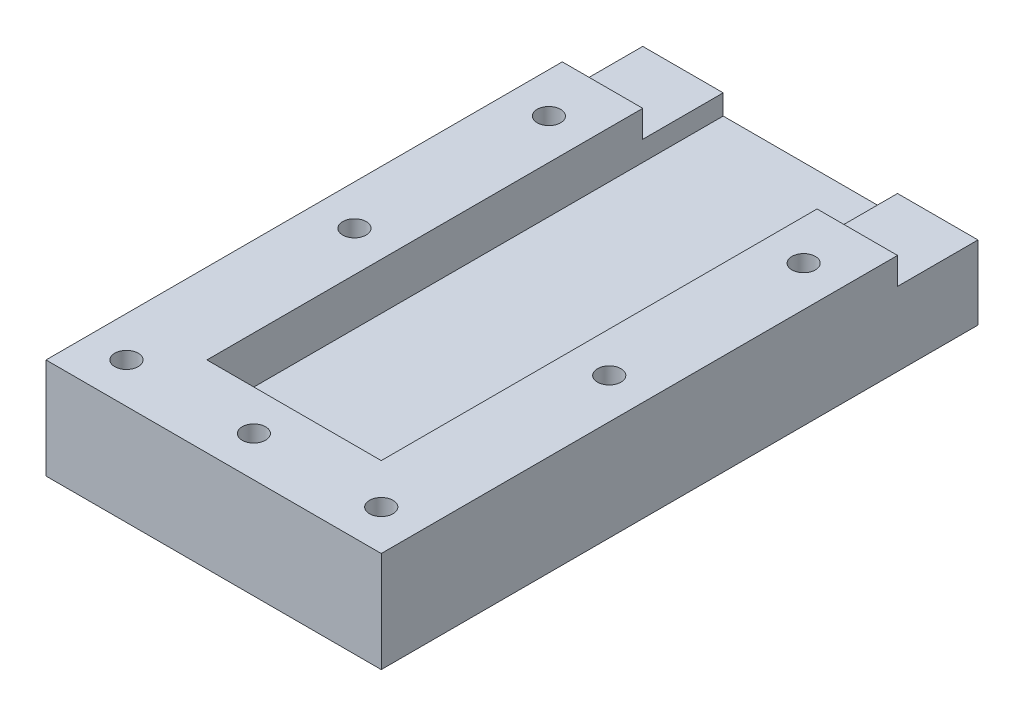
ISO-10303-21;
HEADER;
FILE_DESCRIPTION(('STEP AP214'),'2;1');
FILE_NAME('part.step','',(''),(''),'','','');
FILE_SCHEMA(('AUTOMOTIVE_DESIGN { 1 0 10303 214 1 1 1 1 }'));
ENDSEC;
DATA;
#1=APPLICATION_CONTEXT('core data for automotive mechanical design processes');
#2=APPLICATION_PROTOCOL_DEFINITION('international standard','automotive_design',2000,#1);
#3=PRODUCT_CONTEXT('',#1,'mechanical');
#4=PRODUCT('Part','Part','',(#3));
#5=PRODUCT_RELATED_PRODUCT_CATEGORY('part','',(#4));
#6=PRODUCT_DEFINITION_FORMATION('','',#4);
#7=PRODUCT_DEFINITION_CONTEXT('part definition',#1,'design');
#8=PRODUCT_DEFINITION('design','',#6,#7);
#9=PRODUCT_DEFINITION_SHAPE('','',#8);
#10=(LENGTH_UNIT() NAMED_UNIT(*) SI_UNIT(.MILLI.,.METRE.));
#11=(NAMED_UNIT(*) PLANE_ANGLE_UNIT() SI_UNIT($,.RADIAN.));
#12=(NAMED_UNIT(*) SI_UNIT($,.STERADIAN.) SOLID_ANGLE_UNIT());
#13=UNCERTAINTY_MEASURE_WITH_UNIT(LENGTH_MEASURE(1.E-05),#10,'distance_accuracy_value','');
#14=(GEOMETRIC_REPRESENTATION_CONTEXT(3) GLOBAL_UNCERTAINTY_ASSIGNED_CONTEXT((#13)) GLOBAL_UNIT_ASSIGNED_CONTEXT((#10,
#11,#12)) REPRESENTATION_CONTEXT('',''));
#15=CARTESIAN_POINT('',(0.,0.,0.));
#16=DIRECTION('',(0.,0.,1.));
#17=DIRECTION('',(1.,0.,0.));
#18=AXIS2_PLACEMENT_3D('',#15,#16,#17);
#19=CARTESIAN_POINT('',(0.,0.,0.));
#20=DIRECTION('',(0.,0.,1.));
#21=DIRECTION('',(1.,0.,0.));
#22=AXIS2_PLACEMENT_3D('',#19,#20,#21);
#23=PLANE('',#22);
#24=DIRECTION('',(0.,-1.,0.));
#25=VECTOR('',#24,1.);
#26=CARTESIAN_POINT('',(-25.,15.,0.));
#27=LINE('',#26,#25);
#28=CARTESIAN_POINT('',(-25.,-4.,0.));
#29=VERTEX_POINT('',#28);
#30=CARTESIAN_POINT('',(-25.,-15.,0.));
#31=VERTEX_POINT('',#30);
#32=EDGE_CURVE('E208',#29,#31,#27,.T.);
#33=ORIENTED_EDGE('',*,*,#32,.F.);
#34=DIRECTION('',(1.,0.,0.));
#35=VECTOR('',#34,1.);
#36=CARTESIAN_POINT('',(-25.,-4.,0.));
#37=LINE('',#36,#35);
#38=CARTESIAN_POINT('',(-13.,-4.,0.));
#39=VERTEX_POINT('',#38);
#40=EDGE_CURVE('E159',#29,#39,#37,.T.);
#41=ORIENTED_EDGE('',*,*,#40,.T.);
#42=DIRECTION('',(0.,1.,0.));
#43=VECTOR('',#42,1.);
#44=CARTESIAN_POINT('',(-13.,7.,0.));
#45=LINE('',#44,#43);
#46=CARTESIAN_POINT('',(-13.,-7.,0.));
#47=VERTEX_POINT('',#46);
#48=EDGE_CURVE('E181',#47,#39,#45,.T.);
#49=ORIENTED_EDGE('',*,*,#48,.F.);
#50=DIRECTION('',(-1.,0.,0.));
#51=VECTOR('',#50,1.);
#52=CARTESIAN_POINT('',(-13.,-7.,0.));
#53=LINE('',#52,#51);
#54=CARTESIAN_POINT('',(13.,-7.,0.));
#55=VERTEX_POINT('',#54);
#56=EDGE_CURVE('E189',#55,#47,#53,.T.);
#57=ORIENTED_EDGE('',*,*,#56,.F.);
#58=DIRECTION('',(0.,-1.,0.));
#59=VECTOR('',#58,1.);
#60=CARTESIAN_POINT('',(13.,7.,0.));
#61=LINE('',#60,#59);
#62=CARTESIAN_POINT('',(13.,-4.,0.));
#63=VERTEX_POINT('',#62);
#64=EDGE_CURVE('E176',#63,#55,#61,.T.);
#65=ORIENTED_EDGE('',*,*,#64,.F.);
#66=DIRECTION('',(-1.,0.,0.));
#67=VECTOR('',#66,1.);
#68=CARTESIAN_POINT('',(25.,-4.,0.));
#69=LINE('',#68,#67);
#70=CARTESIAN_POINT('',(25.,-4.,0.));
#71=VERTEX_POINT('',#70);
#72=EDGE_CURVE('E60',#71,#63,#69,.T.);
#73=ORIENTED_EDGE('',*,*,#72,.F.);
#74=DIRECTION('',(0.,1.,0.));
#75=VECTOR('',#74,1.);
#76=CARTESIAN_POINT('',(25.,15.,0.));
#77=LINE('',#76,#75);
#78=CARTESIAN_POINT('',(25.,-15.,0.));
#79=VERTEX_POINT('',#78);
#80=EDGE_CURVE('E196',#79,#71,#77,.T.);
#81=ORIENTED_EDGE('',*,*,#80,.F.);
#82=DIRECTION('',(1.,0.,0.));
#83=VECTOR('',#82,1.);
#84=CARTESIAN_POINT('',(-25.,-15.,0.));
#85=LINE('',#84,#83);
#86=EDGE_CURVE('E202',#31,#79,#85,.T.);
#87=ORIENTED_EDGE('',*,*,#86,.F.);
#88=EDGE_LOOP('',(#33,#41,#49,#57,#65,#73,#81,#87));
#89=FACE_BOUND('',#88,.T.);
#90=ADVANCED_FACE('F36',(#89),#23,.F.);
#91=CARTESIAN_POINT('',(25.,15.,89.));
#92=DIRECTION('',(-1.,0.,0.));
#93=DIRECTION('',(0.,-1.,0.));
#94=AXIS2_PLACEMENT_3D('',#91,#92,#93);
#95=PLANE('',#94);
#96=DIRECTION('',(0.,1.,0.));
#97=VECTOR('',#96,1.);
#98=CARTESIAN_POINT('',(25.,4.,12.));
#99=LINE('',#98,#97);
#100=CARTESIAN_POINT('',(25.,-4.,12.));
#101=VERTEX_POINT('',#100);
#102=CARTESIAN_POINT('',(25.,0.,12.));
#103=VERTEX_POINT('',#102);
#104=EDGE_CURVE('E167',#101,#103,#99,.T.);
#105=ORIENTED_EDGE('',*,*,#104,.T.);
#106=DIRECTION('',(0.,0.,1.));
#107=VECTOR('',#106,1.);
#108=CARTESIAN_POINT('',(25.,0.,89.));
#109=LINE('',#108,#107);
#110=CARTESIAN_POINT('',(25.,0.,89.));
#111=VERTEX_POINT('',#110);
#112=EDGE_CURVE('E442',#103,#111,#109,.T.);
#113=ORIENTED_EDGE('',*,*,#112,.T.);
#114=DIRECTION('',(0.,1.,0.));
#115=VECTOR('',#114,1.);
#116=CARTESIAN_POINT('',(25.,15.,89.));
#117=LINE('',#116,#115);
#118=CARTESIAN_POINT('',(25.,-15.,89.));
#119=VERTEX_POINT('',#118);
#120=EDGE_CURVE('E199',#119,#111,#117,.T.);
#121=ORIENTED_EDGE('',*,*,#120,.F.);
#122=DIRECTION('',(0.,0.,-1.));
#123=VECTOR('',#122,1.);
#124=CARTESIAN_POINT('',(25.,-15.,89.));
#125=LINE('',#124,#123);
#126=EDGE_CURVE('E45',#119,#79,#125,.T.);
#127=ORIENTED_EDGE('',*,*,#126,.T.);
#128=ORIENTED_EDGE('',*,*,#80,.T.);
#129=DIRECTION('',(0.,0.,1.));
#130=VECTOR('',#129,1.);
#131=CARTESIAN_POINT('',(25.,-4.,0.));
#132=LINE('',#131,#130);
#133=EDGE_CURVE('E164',#71,#101,#132,.T.);
#134=ORIENTED_EDGE('',*,*,#133,.T.);
#135=EDGE_LOOP('',(#105,#113,#121,#127,#128,#134));
#136=FACE_BOUND('',#135,.T.);
#137=ADVANCED_FACE('F38',(#136),#95,.F.);
#138=CARTESIAN_POINT('',(-25.,15.,89.));
#139=DIRECTION('',(1.,0.,0.));
#140=DIRECTION('',(0.,0.,-1.));
#141=AXIS2_PLACEMENT_3D('',#138,#139,#140);
#142=PLANE('',#141);
#143=DIRECTION('',(0.,-1.,0.));
#144=VECTOR('',#143,1.);
#145=CARTESIAN_POINT('',(-25.,15.,89.));
#146=LINE('',#145,#144);
#147=CARTESIAN_POINT('',(-25.,0.,89.));
#148=VERTEX_POINT('',#147);
#149=CARTESIAN_POINT('',(-25.,-15.,89.));
#150=VERTEX_POINT('',#149);
#151=EDGE_CURVE('E141',#148,#150,#146,.T.);
#152=ORIENTED_EDGE('',*,*,#151,.F.);
#153=DIRECTION('',(0.,0.,-1.));
#154=VECTOR('',#153,1.);
#155=CARTESIAN_POINT('',(-25.,0.,89.));
#156=LINE('',#155,#154);
#157=CARTESIAN_POINT('',(-25.,0.,12.));
#158=VERTEX_POINT('',#157);
#159=EDGE_CURVE('E127',#148,#158,#156,.T.);
#160=ORIENTED_EDGE('',*,*,#159,.T.);
#161=DIRECTION('',(0.,-1.,0.));
#162=VECTOR('',#161,1.);
#163=CARTESIAN_POINT('',(-25.,4.,12.));
#164=LINE('',#163,#162);
#165=CARTESIAN_POINT('',(-25.,-4.,12.));
#166=VERTEX_POINT('',#165);
#167=EDGE_CURVE('E138',#158,#166,#164,.T.);
#168=ORIENTED_EDGE('',*,*,#167,.T.);
#169=DIRECTION('',(0.,0.,-1.));
#170=VECTOR('',#169,1.);
#171=CARTESIAN_POINT('',(-25.,-4.,0.));
#172=LINE('',#171,#170);
#173=EDGE_CURVE('E148',#166,#29,#172,.T.);
#174=ORIENTED_EDGE('',*,*,#173,.T.);
#175=ORIENTED_EDGE('',*,*,#32,.T.);
#176=DIRECTION('',(0.,0.,-1.));
#177=VECTOR('',#176,1.);
#178=CARTESIAN_POINT('',(-25.,-15.,89.));
#179=LINE('',#178,#177);
#180=EDGE_CURVE('E12',#150,#31,#179,.T.);
#181=ORIENTED_EDGE('',*,*,#180,.F.);
#182=EDGE_LOOP('',(#152,#160,#168,#174,#175,#181));
#183=FACE_BOUND('',#182,.T.);
#184=ADVANCED_FACE('F136',(#183),#142,.F.);
#185=CARTESIAN_POINT('',(-25.,-15.,89.));
#186=DIRECTION('',(0.,1.,0.));
#187=DIRECTION('',(0.,0.,1.));
#188=AXIS2_PLACEMENT_3D('',#185,#186,#187);
#189=PLANE('',#188);
#190=CARTESIAN_POINT('',(19.,-15.,49.));
#191=DIRECTION('',(0.,1.,0.));
#192=DIRECTION('',(0.,0.,1.));
#193=AXIS2_PLACEMENT_3D('',#190,#191,#192);
#194=CIRCLE('',#193,1.75);
#195=CARTESIAN_POINT('',(19.,-15.,50.75));
#196=VERTEX_POINT('',#195);
#197=EDGE_CURVE('E452',#196,#196,#194,.T.);
#198=ORIENTED_EDGE('',*,*,#197,.T.);
#199=EDGE_LOOP('',(#198));
#200=FACE_BOUND('',#199,.T.);
#201=CARTESIAN_POINT('',(19.,-15.,83.));
#202=DIRECTION('',(0.,1.,0.));
#203=DIRECTION('',(0.,0.,1.));
#204=AXIS2_PLACEMENT_3D('',#201,#202,#203);
#205=CIRCLE('',#204,1.75);
#206=CARTESIAN_POINT('',(19.,-15.,84.75));
#207=VERTEX_POINT('',#206);
#208=EDGE_CURVE('E455',#207,#207,#205,.T.);
#209=ORIENTED_EDGE('',*,*,#208,.T.);
#210=EDGE_LOOP('',(#209));
#211=FACE_BOUND('',#210,.T.);
#212=CARTESIAN_POINT('',(0.,-15.,83.));
#213=DIRECTION('',(0.,1.,0.));
#214=DIRECTION('',(0.,0.,1.));
#215=AXIS2_PLACEMENT_3D('',#212,#213,#214);
#216=CIRCLE('',#215,1.75);
#217=CARTESIAN_POINT('',(0.,-15.,84.75));
#218=VERTEX_POINT('',#217);
#219=EDGE_CURVE('E458',#218,#218,#216,.T.);
#220=ORIENTED_EDGE('',*,*,#219,.T.);
#221=EDGE_LOOP('',(#220));
#222=FACE_BOUND('',#221,.T.);
#223=CARTESIAN_POINT('',(-19.,-15.,83.));
#224=DIRECTION('',(0.,1.,0.));
#225=DIRECTION('',(0.,0.,1.));
#226=AXIS2_PLACEMENT_3D('',#223,#224,#225);
#227=CIRCLE('',#226,1.75);
#228=CARTESIAN_POINT('',(-19.,-15.,84.75));
#229=VERTEX_POINT('',#228);
#230=EDGE_CURVE('E449',#229,#229,#227,.T.);
#231=ORIENTED_EDGE('',*,*,#230,.T.);
#232=EDGE_LOOP('',(#231));
#233=FACE_BOUND('',#232,.T.);
#234=CARTESIAN_POINT('',(-19.,-15.,49.));
#235=DIRECTION('',(0.,1.,0.));
#236=DIRECTION('',(0.,0.,1.));
#237=AXIS2_PLACEMENT_3D('',#234,#235,#236);
#238=CIRCLE('',#237,1.75);
#239=CARTESIAN_POINT('',(-19.,-15.,50.75));
#240=VERTEX_POINT('',#239);
#241=EDGE_CURVE('E446',#240,#240,#238,.T.);
#242=ORIENTED_EDGE('',*,*,#241,.T.);
#243=EDGE_LOOP('',(#242));
#244=FACE_BOUND('',#243,.T.);
#245=CARTESIAN_POINT('',(-19.,-15.,20.));
#246=DIRECTION('',(0.,1.,0.));
#247=DIRECTION('',(0.,0.,1.));
#248=AXIS2_PLACEMENT_3D('',#245,#246,#247);
#249=CIRCLE('',#248,1.75);
#250=CARTESIAN_POINT('',(-19.,-15.,21.75));
#251=VERTEX_POINT('',#250);
#252=EDGE_CURVE('E445',#251,#251,#249,.T.);
#253=ORIENTED_EDGE('',*,*,#252,.T.);
#254=EDGE_LOOP('',(#253));
#255=FACE_BOUND('',#254,.T.);
#256=CARTESIAN_POINT('',(19.,-15.,20.));
#257=DIRECTION('',(0.,1.,0.));
#258=DIRECTION('',(0.,0.,1.));
#259=AXIS2_PLACEMENT_3D('',#256,#257,#258);
#260=CIRCLE('',#259,1.75);
#261=CARTESIAN_POINT('',(19.,-15.,21.75));
#262=VERTEX_POINT('',#261);
#263=EDGE_CURVE('E155',#262,#262,#260,.T.);
#264=ORIENTED_EDGE('',*,*,#263,.T.);
#265=EDGE_LOOP('',(#264));
#266=FACE_BOUND('',#265,.T.);
#267=ORIENTED_EDGE('',*,*,#86,.T.);
#268=ORIENTED_EDGE('',*,*,#126,.F.);
#269=DIRECTION('',(1.,0.,0.));
#270=VECTOR('',#269,1.);
#271=CARTESIAN_POINT('',(-25.,-15.,89.));
#272=LINE('',#271,#270);
#273=EDGE_CURVE('E204',#150,#119,#272,.T.);
#274=ORIENTED_EDGE('',*,*,#273,.F.);
#275=ORIENTED_EDGE('',*,*,#180,.T.);
#276=EDGE_LOOP('',(#267,#268,#274,#275));
#277=FACE_BOUND('',#276,.T.);
#278=ADVANCED_FACE('F267',(#200,#211,#222,#233,#244,#255,#266,#277),#189,.F.);
#279=CARTESIAN_POINT('',(0.,0.,89.));
#280=DIRECTION('',(0.,0.,1.));
#281=DIRECTION('',(1.,0.,0.));
#282=AXIS2_PLACEMENT_3D('',#279,#280,#281);
#283=PLANE('',#282);
#284=DIRECTION('',(1.,0.,0.));
#285=VECTOR('',#284,1.);
#286=CARTESIAN_POINT('',(0.,0.,89.));
#287=LINE('',#286,#285);
#288=EDGE_CURVE('E239',#148,#111,#287,.T.);
#289=ORIENTED_EDGE('',*,*,#288,.F.);
#290=ORIENTED_EDGE('',*,*,#151,.T.);
#291=ORIENTED_EDGE('',*,*,#273,.T.);
#292=ORIENTED_EDGE('',*,*,#120,.T.);
#293=EDGE_LOOP('',(#289,#290,#291,#292));
#294=FACE_BOUND('',#293,.T.);
#295=ADVANCED_FACE('F265',(#294),#283,.T.);
#296=CARTESIAN_POINT('',(13.,7.,77.));
#297=DIRECTION('',(1.,0.,0.));
#298=DIRECTION('',(0.,1.,0.));
#299=AXIS2_PLACEMENT_3D('',#296,#297,#298);
#300=PLANE('',#299);
#301=DIRECTION('',(0.,-1.,0.));
#302=VECTOR('',#301,1.);
#303=CARTESIAN_POINT('',(13.,7.,77.));
#304=LINE('',#303,#302);
#305=CARTESIAN_POINT('',(13.,0.,77.));
#306=VERTEX_POINT('',#305);
#307=CARTESIAN_POINT('',(13.,-7.,77.));
#308=VERTEX_POINT('',#307);
#309=EDGE_CURVE('E178',#306,#308,#304,.T.);
#310=ORIENTED_EDGE('',*,*,#309,.F.);
#311=DIRECTION('',(0.,0.,-1.));
#312=VECTOR('',#311,1.);
#313=CARTESIAN_POINT('',(13.,0.,77.));
#314=LINE('',#313,#312);
#315=CARTESIAN_POINT('',(13.,0.,12.));
#316=VERTEX_POINT('',#315);
#317=EDGE_CURVE('E238',#306,#316,#314,.T.);
#318=ORIENTED_EDGE('',*,*,#317,.T.);
#319=DIRECTION('',(0.,1.,0.));
#320=VECTOR('',#319,1.);
#321=CARTESIAN_POINT('',(13.,4.,12.));
#322=LINE('',#321,#320);
#323=CARTESIAN_POINT('',(13.,-4.,12.));
#324=VERTEX_POINT('',#323);
#325=EDGE_CURVE('E168',#324,#316,#322,.T.);
#326=ORIENTED_EDGE('',*,*,#325,.F.);
#327=DIRECTION('',(0.,0.,1.));
#328=VECTOR('',#327,1.);
#329=CARTESIAN_POINT('',(13.,-4.,0.));
#330=LINE('',#329,#328);
#331=EDGE_CURVE('E162',#63,#324,#330,.T.);
#332=ORIENTED_EDGE('',*,*,#331,.F.);
#333=ORIENTED_EDGE('',*,*,#64,.T.);
#334=DIRECTION('',(0.,0.,-1.));
#335=VECTOR('',#334,1.);
#336=CARTESIAN_POINT('',(13.,-7.,77.));
#337=LINE('',#336,#335);
#338=EDGE_CURVE('E187',#308,#55,#337,.T.);
#339=ORIENTED_EDGE('',*,*,#338,.F.);
#340=EDGE_LOOP('',(#310,#318,#326,#332,#333,#339));
#341=FACE_BOUND('',#340,.T.);
#342=ADVANCED_FACE('F228',(#341),#300,.F.);
#343=CARTESIAN_POINT('',(-13.,7.,77.));
#344=DIRECTION('',(-1.,0.,0.));
#345=DIRECTION('',(0.,-1.,0.));
#346=AXIS2_PLACEMENT_3D('',#343,#344,#345);
#347=PLANE('',#346);
#348=DIRECTION('',(0.,-1.,0.));
#349=VECTOR('',#348,1.);
#350=CARTESIAN_POINT('',(-13.,4.,12.));
#351=LINE('',#350,#349);
#352=CARTESIAN_POINT('',(-13.,0.,12.));
#353=VERTEX_POINT('',#352);
#354=CARTESIAN_POINT('',(-13.,-4.,12.));
#355=VERTEX_POINT('',#354);
#356=EDGE_CURVE('E152',#353,#355,#351,.T.);
#357=ORIENTED_EDGE('',*,*,#356,.F.);
#358=DIRECTION('',(0.,0.,1.));
#359=VECTOR('',#358,1.);
#360=CARTESIAN_POINT('',(-13.,0.,77.));
#361=LINE('',#360,#359);
#362=CARTESIAN_POINT('',(-13.,0.,77.));
#363=VERTEX_POINT('',#362);
#364=EDGE_CURVE('E52',#353,#363,#361,.T.);
#365=ORIENTED_EDGE('',*,*,#364,.T.);
#366=DIRECTION('',(0.,1.,0.));
#367=VECTOR('',#366,1.);
#368=CARTESIAN_POINT('',(-13.,7.,77.));
#369=LINE('',#368,#367);
#370=CARTESIAN_POINT('',(-13.,-7.,77.));
#371=VERTEX_POINT('',#370);
#372=EDGE_CURVE('E184',#371,#363,#369,.T.);
#373=ORIENTED_EDGE('',*,*,#372,.F.);
#374=DIRECTION('',(0.,0.,-1.));
#375=VECTOR('',#374,1.);
#376=CARTESIAN_POINT('',(-13.,-7.,77.));
#377=LINE('',#376,#375);
#378=EDGE_CURVE('E194',#371,#47,#377,.T.);
#379=ORIENTED_EDGE('',*,*,#378,.T.);
#380=ORIENTED_EDGE('',*,*,#48,.T.);
#381=DIRECTION('',(0.,0.,-1.));
#382=VECTOR('',#381,1.);
#383=CARTESIAN_POINT('',(-13.,-4.,0.));
#384=LINE('',#383,#382);
#385=EDGE_CURVE('E149',#355,#39,#384,.T.);
#386=ORIENTED_EDGE('',*,*,#385,.F.);
#387=EDGE_LOOP('',(#357,#365,#373,#379,#380,#386));
#388=FACE_BOUND('',#387,.T.);
#389=ADVANCED_FACE('F292',(#388),#347,.F.);
#390=CARTESIAN_POINT('',(-13.,-7.,77.));
#391=DIRECTION('',(0.,-1.,0.));
#392=DIRECTION('',(1.,0.,0.));
#393=AXIS2_PLACEMENT_3D('',#390,#391,#392);
#394=PLANE('',#393);
#395=ORIENTED_EDGE('',*,*,#56,.T.);
#396=ORIENTED_EDGE('',*,*,#378,.F.);
#397=DIRECTION('',(-1.,0.,0.));
#398=VECTOR('',#397,1.);
#399=CARTESIAN_POINT('',(-13.,-7.,77.));
#400=LINE('',#399,#398);
#401=EDGE_CURVE('E180',#308,#371,#400,.T.);
#402=ORIENTED_EDGE('',*,*,#401,.F.);
#403=ORIENTED_EDGE('',*,*,#338,.T.);
#404=EDGE_LOOP('',(#395,#396,#402,#403));
#405=FACE_BOUND('',#404,.T.);
#406=ADVANCED_FACE('F232',(#405),#394,.F.);
#407=CARTESIAN_POINT('',(0.,0.,77.));
#408=DIRECTION('',(0.,0.,1.));
#409=DIRECTION('',(1.,0.,0.));
#410=AXIS2_PLACEMENT_3D('',#407,#408,#409);
#411=PLANE('',#410);
#412=ORIENTED_EDGE('',*,*,#372,.T.);
#413=DIRECTION('',(1.,0.,0.));
#414=VECTOR('',#413,1.);
#415=CARTESIAN_POINT('',(0.,0.,77.));
#416=LINE('',#415,#414);
#417=EDGE_CURVE('E142',#363,#306,#416,.T.);
#418=ORIENTED_EDGE('',*,*,#417,.T.);
#419=ORIENTED_EDGE('',*,*,#309,.T.);
#420=ORIENTED_EDGE('',*,*,#401,.T.);
#421=EDGE_LOOP('',(#412,#418,#419,#420));
#422=FACE_BOUND('',#421,.T.);
#423=ADVANCED_FACE('F235',(#422),#411,.F.);
#424=CARTESIAN_POINT('',(25.,4.,12.));
#425=DIRECTION('',(0.,0.,1.));
#426=DIRECTION('',(0.,-1.,0.));
#427=AXIS2_PLACEMENT_3D('',#424,#425,#426);
#428=PLANE('',#427);
#429=ORIENTED_EDGE('',*,*,#325,.T.);
#430=DIRECTION('',(1.,0.,0.));
#431=VECTOR('',#430,1.);
#432=CARTESIAN_POINT('',(25.,0.,12.));
#433=LINE('',#432,#431);
#434=EDGE_CURVE('E245',#316,#103,#433,.T.);
#435=ORIENTED_EDGE('',*,*,#434,.T.);
#436=ORIENTED_EDGE('',*,*,#104,.F.);
#437=DIRECTION('',(-1.,0.,0.));
#438=VECTOR('',#437,1.);
#439=CARTESIAN_POINT('',(25.,-4.,12.));
#440=LINE('',#439,#438);
#441=EDGE_CURVE('E174',#101,#324,#440,.T.);
#442=ORIENTED_EDGE('',*,*,#441,.T.);
#443=EDGE_LOOP('',(#429,#435,#436,#442));
#444=FACE_BOUND('',#443,.T.);
#445=ADVANCED_FACE('F243',(#444),#428,.F.);
#446=CARTESIAN_POINT('',(25.,-4.,0.));
#447=DIRECTION('',(0.,-1.,0.));
#448=DIRECTION('',(1.,0.,0.));
#449=AXIS2_PLACEMENT_3D('',#446,#447,#448);
#450=PLANE('',#449);
#451=ORIENTED_EDGE('',*,*,#331,.T.);
#452=ORIENTED_EDGE('',*,*,#441,.F.);
#453=ORIENTED_EDGE('',*,*,#133,.F.);
#454=ORIENTED_EDGE('',*,*,#72,.T.);
#455=EDGE_LOOP('',(#451,#452,#453,#454));
#456=FACE_BOUND('',#455,.T.);
#457=ADVANCED_FACE('F246',(#456),#450,.F.);
#458=CARTESIAN_POINT('',(-25.,-4.,0.));
#459=DIRECTION('',(0.,-1.,0.));
#460=DIRECTION('',(1.,0.,0.));
#461=AXIS2_PLACEMENT_3D('',#458,#459,#460);
#462=PLANE('',#461);
#463=ORIENTED_EDGE('',*,*,#385,.T.);
#464=ORIENTED_EDGE('',*,*,#40,.F.);
#465=ORIENTED_EDGE('',*,*,#173,.F.);
#466=DIRECTION('',(1.,0.,0.));
#467=VECTOR('',#466,1.);
#468=CARTESIAN_POINT('',(-25.,-4.,12.));
#469=LINE('',#468,#467);
#470=EDGE_CURVE('E146',#166,#355,#469,.T.);
#471=ORIENTED_EDGE('',*,*,#470,.T.);
#472=EDGE_LOOP('',(#463,#464,#465,#471));
#473=FACE_BOUND('',#472,.T.);
#474=ADVANCED_FACE('F248',(#473),#462,.F.);
#475=CARTESIAN_POINT('',(-25.,4.,12.));
#476=DIRECTION('',(0.,0.,1.));
#477=DIRECTION('',(1.,0.,0.));
#478=AXIS2_PLACEMENT_3D('',#475,#476,#477);
#479=PLANE('',#478);
#480=ORIENTED_EDGE('',*,*,#167,.F.);
#481=DIRECTION('',(1.,0.,0.));
#482=VECTOR('',#481,1.);
#483=CARTESIAN_POINT('',(-25.,0.,12.));
#484=LINE('',#483,#482);
#485=EDGE_CURVE('E124',#158,#353,#484,.T.);
#486=ORIENTED_EDGE('',*,*,#485,.T.);
#487=ORIENTED_EDGE('',*,*,#356,.T.);
#488=ORIENTED_EDGE('',*,*,#470,.F.);
#489=EDGE_LOOP('',(#480,#486,#487,#488));
#490=FACE_BOUND('',#489,.T.);
#491=ADVANCED_FACE('F144',(#490),#479,.F.);
#492=CARTESIAN_POINT('',(19.,-15.,20.));
#493=DIRECTION('',(0.,1.,0.));
#494=DIRECTION('',(0.,0.,1.));
#495=AXIS2_PLACEMENT_3D('',#492,#493,#494);
#496=CYLINDRICAL_SURFACE('',#495,1.75);
#497=CARTESIAN_POINT('',(19.,0.,20.));
#498=DIRECTION('',(0.,-1.,0.));
#499=DIRECTION('',(0.,0.,-1.));
#500=AXIS2_PLACEMENT_3D('',#497,#498,#499);
#501=CIRCLE('',#500,1.75);
#502=CARTESIAN_POINT('',(19.,0.,18.25));
#503=VERTEX_POINT('',#502);
#504=EDGE_CURVE('E132',#503,#503,#501,.F.);
#505=ORIENTED_EDGE('',*,*,#504,.T.);
#506=EDGE_LOOP('',(#505));
#507=FACE_BOUND('',#506,.T.);
#508=ORIENTED_EDGE('',*,*,#263,.F.);
#509=EDGE_LOOP('',(#508));
#510=FACE_BOUND('',#509,.T.);
#511=ADVANCED_FACE('F324',(#507,#510),#496,.F.);
#512=CARTESIAN_POINT('',(-19.,-15.,20.));
#513=DIRECTION('',(0.,1.,0.));
#514=DIRECTION('',(0.,0.,1.));
#515=AXIS2_PLACEMENT_3D('',#512,#513,#514);
#516=CYLINDRICAL_SURFACE('',#515,1.75);
#517=CARTESIAN_POINT('',(-19.,0.,20.));
#518=DIRECTION('',(0.,-1.,0.));
#519=DIRECTION('',(0.,0.,-1.));
#520=AXIS2_PLACEMENT_3D('',#517,#518,#519);
#521=CIRCLE('',#520,1.75);
#522=CARTESIAN_POINT('',(-19.,0.,18.25));
#523=VERTEX_POINT('',#522);
#524=EDGE_CURVE('E413',#523,#523,#521,.F.);
#525=ORIENTED_EDGE('',*,*,#524,.T.);
#526=EDGE_LOOP('',(#525));
#527=FACE_BOUND('',#526,.T.);
#528=ORIENTED_EDGE('',*,*,#252,.F.);
#529=EDGE_LOOP('',(#528));
#530=FACE_BOUND('',#529,.T.);
#531=ADVANCED_FACE('F334',(#527,#530),#516,.F.);
#532=CARTESIAN_POINT('',(-19.,-15.,49.));
#533=DIRECTION('',(0.,1.,0.));
#534=DIRECTION('',(0.,0.,1.));
#535=AXIS2_PLACEMENT_3D('',#532,#533,#534);
#536=CYLINDRICAL_SURFACE('',#535,1.75);
#537=CARTESIAN_POINT('',(-19.,0.,49.));
#538=DIRECTION('',(0.,-1.,0.));
#539=DIRECTION('',(0.,0.,-1.));
#540=AXIS2_PLACEMENT_3D('',#537,#538,#539);
#541=CIRCLE('',#540,1.75);
#542=CARTESIAN_POINT('',(-19.,0.,47.25));
#543=VERTEX_POINT('',#542);
#544=EDGE_CURVE('E417',#543,#543,#541,.F.);
#545=ORIENTED_EDGE('',*,*,#544,.T.);
#546=EDGE_LOOP('',(#545));
#547=FACE_BOUND('',#546,.T.);
#548=ORIENTED_EDGE('',*,*,#241,.F.);
#549=EDGE_LOOP('',(#548));
#550=FACE_BOUND('',#549,.T.);
#551=ADVANCED_FACE('F344',(#547,#550),#536,.F.);
#552=CARTESIAN_POINT('',(-19.,-15.,83.));
#553=DIRECTION('',(0.,1.,0.));
#554=DIRECTION('',(0.,0.,1.));
#555=AXIS2_PLACEMENT_3D('',#552,#553,#554);
#556=CYLINDRICAL_SURFACE('',#555,1.75);
#557=CARTESIAN_POINT('',(-19.,0.,83.));
#558=DIRECTION('',(0.,-1.,0.));
#559=DIRECTION('',(0.,0.,-1.));
#560=AXIS2_PLACEMENT_3D('',#557,#558,#559);
#561=CIRCLE('',#560,1.75);
#562=CARTESIAN_POINT('',(-19.,0.,81.25));
#563=VERTEX_POINT('',#562);
#564=EDGE_CURVE('E421',#563,#563,#561,.F.);
#565=ORIENTED_EDGE('',*,*,#564,.T.);
#566=EDGE_LOOP('',(#565));
#567=FACE_BOUND('',#566,.T.);
#568=ORIENTED_EDGE('',*,*,#230,.F.);
#569=EDGE_LOOP('',(#568));
#570=FACE_BOUND('',#569,.T.);
#571=ADVANCED_FACE('F354',(#567,#570),#556,.F.);
#572=CARTESIAN_POINT('',(0.,-15.,83.));
#573=DIRECTION('',(0.,1.,0.));
#574=DIRECTION('',(0.,0.,1.));
#575=AXIS2_PLACEMENT_3D('',#572,#573,#574);
#576=CYLINDRICAL_SURFACE('',#575,1.75);
#577=CARTESIAN_POINT('',(0.,0.,83.));
#578=DIRECTION('',(0.,-1.,0.));
#579=DIRECTION('',(0.,0.,-1.));
#580=AXIS2_PLACEMENT_3D('',#577,#578,#579);
#581=CIRCLE('',#580,1.75);
#582=CARTESIAN_POINT('',(0.,0.,81.25));
#583=VERTEX_POINT('',#582);
#584=EDGE_CURVE('E425',#583,#583,#581,.F.);
#585=ORIENTED_EDGE('',*,*,#584,.T.);
#586=EDGE_LOOP('',(#585));
#587=FACE_BOUND('',#586,.T.);
#588=ORIENTED_EDGE('',*,*,#219,.F.);
#589=EDGE_LOOP('',(#588));
#590=FACE_BOUND('',#589,.T.);
#591=ADVANCED_FACE('F364',(#587,#590),#576,.F.);
#592=CARTESIAN_POINT('',(19.,-15.,83.));
#593=DIRECTION('',(0.,1.,0.));
#594=DIRECTION('',(0.,0.,1.));
#595=AXIS2_PLACEMENT_3D('',#592,#593,#594);
#596=CYLINDRICAL_SURFACE('',#595,1.75);
#597=CARTESIAN_POINT('',(19.,0.,83.));
#598=DIRECTION('',(0.,-1.,0.));
#599=DIRECTION('',(0.,0.,-1.));
#600=AXIS2_PLACEMENT_3D('',#597,#598,#599);
#601=CIRCLE('',#600,1.75);
#602=CARTESIAN_POINT('',(19.,0.,81.25));
#603=VERTEX_POINT('',#602);
#604=EDGE_CURVE('E429',#603,#603,#601,.F.);
#605=ORIENTED_EDGE('',*,*,#604,.T.);
#606=EDGE_LOOP('',(#605));
#607=FACE_BOUND('',#606,.T.);
#608=ORIENTED_EDGE('',*,*,#208,.F.);
#609=EDGE_LOOP('',(#608));
#610=FACE_BOUND('',#609,.T.);
#611=ADVANCED_FACE('F374',(#607,#610),#596,.F.);
#612=CARTESIAN_POINT('',(19.,-15.,49.));
#613=DIRECTION('',(0.,1.,0.));
#614=DIRECTION('',(0.,0.,1.));
#615=AXIS2_PLACEMENT_3D('',#612,#613,#614);
#616=CYLINDRICAL_SURFACE('',#615,1.75);
#617=CARTESIAN_POINT('',(19.,0.,49.));
#618=DIRECTION('',(0.,-1.,0.));
#619=DIRECTION('',(0.,0.,-1.));
#620=AXIS2_PLACEMENT_3D('',#617,#618,#619);
#621=CIRCLE('',#620,1.75);
#622=CARTESIAN_POINT('',(19.,0.,47.25));
#623=VERTEX_POINT('',#622);
#624=EDGE_CURVE('E40',#623,#623,#621,.F.);
#625=ORIENTED_EDGE('',*,*,#624,.T.);
#626=EDGE_LOOP('',(#625));
#627=FACE_BOUND('',#626,.T.);
#628=ORIENTED_EDGE('',*,*,#197,.F.);
#629=EDGE_LOOP('',(#628));
#630=FACE_BOUND('',#629,.T.);
#631=ADVANCED_FACE('F384',(#627,#630),#616,.F.);
#632=CARTESIAN_POINT('',(0.,0.,0.));
#633=DIRECTION('',(0.,-1.,0.));
#634=DIRECTION('',(0.,0.,-1.));
#635=AXIS2_PLACEMENT_3D('',#632,#633,#634);
#636=PLANE('',#635);
#637=ORIENTED_EDGE('',*,*,#504,.F.);
#638=EDGE_LOOP('',(#637));
#639=FACE_BOUND('',#638,.T.);
#640=ORIENTED_EDGE('',*,*,#524,.F.);
#641=EDGE_LOOP('',(#640));
#642=FACE_BOUND('',#641,.T.);
#643=ORIENTED_EDGE('',*,*,#544,.F.);
#644=EDGE_LOOP('',(#643));
#645=FACE_BOUND('',#644,.T.);
#646=ORIENTED_EDGE('',*,*,#564,.F.);
#647=EDGE_LOOP('',(#646));
#648=FACE_BOUND('',#647,.T.);
#649=ORIENTED_EDGE('',*,*,#584,.F.);
#650=EDGE_LOOP('',(#649));
#651=FACE_BOUND('',#650,.T.);
#652=ORIENTED_EDGE('',*,*,#604,.F.);
#653=EDGE_LOOP('',(#652));
#654=FACE_BOUND('',#653,.T.);
#655=ORIENTED_EDGE('',*,*,#624,.F.);
#656=EDGE_LOOP('',(#655));
#657=FACE_BOUND('',#656,.T.);
#658=ORIENTED_EDGE('',*,*,#434,.F.);
#659=ORIENTED_EDGE('',*,*,#317,.F.);
#660=ORIENTED_EDGE('',*,*,#417,.F.);
#661=ORIENTED_EDGE('',*,*,#364,.F.);
#662=ORIENTED_EDGE('',*,*,#485,.F.);
#663=ORIENTED_EDGE('',*,*,#159,.F.);
#664=ORIENTED_EDGE('',*,*,#288,.T.);
#665=ORIENTED_EDGE('',*,*,#112,.F.);
#666=EDGE_LOOP('',(#658,#659,#660,#661,#662,#663,#664,#665));
#667=FACE_BOUND('',#666,.T.);
#668=ADVANCED_FACE('F126',(#639,#642,#645,#648,#651,#654,#657,#667),#636,.F.);
#669=CLOSED_SHELL('',(#90,#137,#184,#278,#295,#342,#389,#406,#423,#445,#457,#474,#491,#511,#531,
#551,#571,#591,#611,#631,#668));
#670=MANIFOLD_SOLID_BREP('B2',#669);
#671=ADVANCED_BREP_SHAPE_REPRESENTATION('',(#18,#670),#14);
#672=SHAPE_DEFINITION_REPRESENTATION(#9,#671);
ENDSEC;
END-ISO-10303-21;
